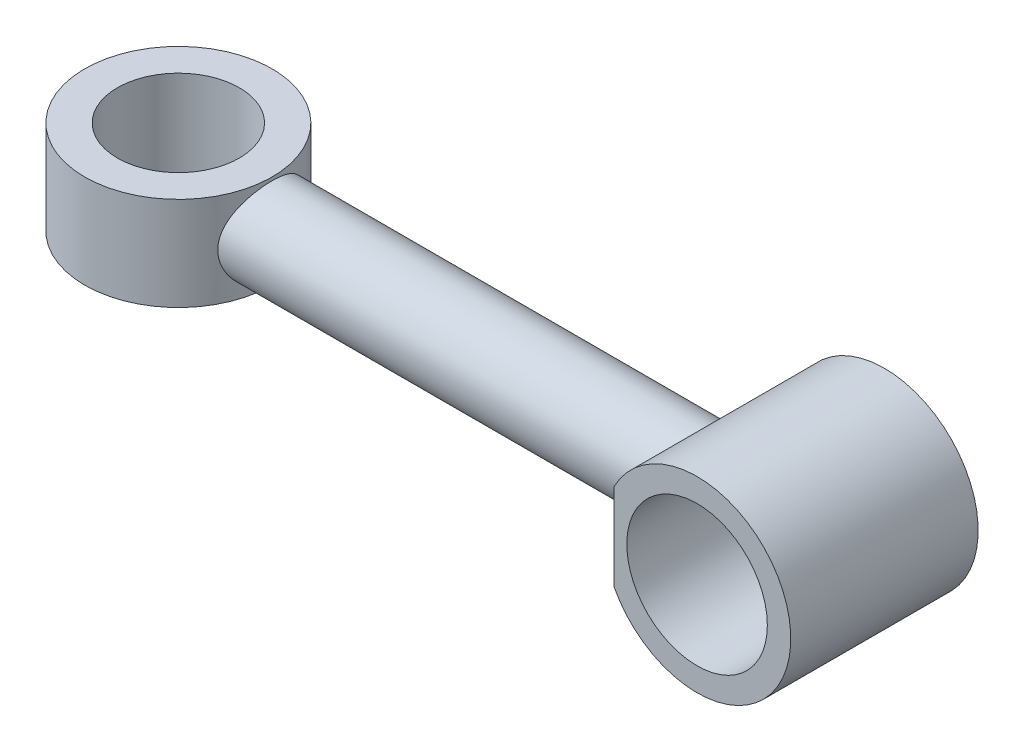
ISO-10303-21;
HEADER;
FILE_DESCRIPTION(('STEP AP214'),'2;1');
FILE_NAME('part.step','',(''),(''),'','','');
FILE_SCHEMA(('AUTOMOTIVE_DESIGN { 1 0 10303 214 1 1 1 1 }'));
ENDSEC;
DATA;
#1=APPLICATION_CONTEXT('core data for automotive mechanical design processes');
#2=APPLICATION_PROTOCOL_DEFINITION('international standard','automotive_design',2000,#1);
#3=PRODUCT_CONTEXT('',#1,'mechanical');
#4=PRODUCT('Part','Part','',(#3));
#5=PRODUCT_RELATED_PRODUCT_CATEGORY('part','',(#4));
#6=PRODUCT_DEFINITION_FORMATION('','',#4);
#7=PRODUCT_DEFINITION_CONTEXT('part definition',#1,'design');
#8=PRODUCT_DEFINITION('design','',#6,#7);
#9=PRODUCT_DEFINITION_SHAPE('','',#8);
#10=(LENGTH_UNIT() NAMED_UNIT(*) SI_UNIT(.MILLI.,.METRE.));
#11=(NAMED_UNIT(*) PLANE_ANGLE_UNIT() SI_UNIT($,.RADIAN.));
#12=(NAMED_UNIT(*) SI_UNIT($,.STERADIAN.) SOLID_ANGLE_UNIT());
#13=UNCERTAINTY_MEASURE_WITH_UNIT(LENGTH_MEASURE(1.E-05),#10,'distance_accuracy_value','');
#14=(GEOMETRIC_REPRESENTATION_CONTEXT(3) GLOBAL_UNCERTAINTY_ASSIGNED_CONTEXT((#13)) GLOBAL_UNIT_ASSIGNED_CONTEXT((#10,
#11,#12)) REPRESENTATION_CONTEXT('',''));
#15=CARTESIAN_POINT('',(0.,0.,0.));
#16=DIRECTION('',(0.,0.,1.));
#17=DIRECTION('',(1.,0.,0.));
#18=AXIS2_PLACEMENT_3D('',#15,#16,#17);
#19=CARTESIAN_POINT('',(-8.85201294053231,4.6520819963376,0.));
#20=DIRECTION('',(1.,0.,0.));
#21=DIRECTION('',(0.,0.,-1.));
#22=AXIS2_PLACEMENT_3D('',#19,#20,#21);
#23=PLANE('',#22);
#24=CARTESIAN_POINT('',(-8.85201294053231,0.,10.));
#25=DIRECTION('',(1.,0.,0.));
#26=DIRECTION('',(0.,0.,-1.));
#27=AXIS2_PLACEMENT_3D('',#24,#25,#26);
#28=CIRCLE('',#27,4.6520819963376);
#29=CARTESIAN_POINT('',(-8.85201294053231,-4.6520819963376,10.));
#30=VERTEX_POINT('',#29);
#31=CARTESIAN_POINT('',(-8.85201294053231,4.6520819963376,10.));
#32=VERTEX_POINT('',#31);
#33=EDGE_CURVE('E11',#30,#32,#28,.F.);
#34=ORIENTED_EDGE('',*,*,#33,.F.);
#35=DIRECTION('',(0.,0.,1.));
#36=VECTOR('',#35,1.);
#37=CARTESIAN_POINT('',(-8.85201294053231,-4.6520819963376,0.));
#38=LINE('',#37,#36);
#39=CARTESIAN_POINT('',(-8.85201294053231,-4.6520819963376,20.));
#40=VERTEX_POINT('',#39);
#41=EDGE_CURVE('E88',#30,#40,#38,.T.);
#42=ORIENTED_EDGE('',*,*,#41,.T.);
#43=DIRECTION('',(0.,1.,0.));
#44=VECTOR('',#43,1.);
#45=CARTESIAN_POINT('',(-8.85201294053231,4.6520819963376,20.));
#46=LINE('',#45,#44);
#47=CARTESIAN_POINT('',(-8.85201294053231,4.6520819963376,20.));
#48=VERTEX_POINT('',#47);
#49=EDGE_CURVE('E98',#40,#48,#46,.T.);
#50=ORIENTED_EDGE('',*,*,#49,.T.);
#51=DIRECTION('',(0.,0.,1.));
#52=VECTOR('',#51,1.);
#53=CARTESIAN_POINT('',(-8.85201294053231,4.6520819963376,0.));
#54=LINE('',#53,#52);
#55=EDGE_CURVE('E68',#32,#48,#54,.T.);
#56=ORIENTED_EDGE('',*,*,#55,.F.);
#57=EDGE_LOOP('',(#34,#42,#50,#56));
#58=FACE_BOUND('',#57,.T.);
#59=ADVANCED_FACE('F39',(#58),#23,.F.);
#60=CARTESIAN_POINT('',(0.,0.,20.));
#61=DIRECTION('',(0.,0.,1.));
#62=DIRECTION('',(1.,0.,0.));
#63=AXIS2_PLACEMENT_3D('',#60,#61,#62);
#64=PLANE('',#63);
#65=ORIENTED_EDGE('',*,*,#49,.F.);
#66=CARTESIAN_POINT('',(0.,0.,20.));
#67=DIRECTION('',(0.,0.,1.));
#68=DIRECTION('',(1.,0.,0.));
#69=AXIS2_PLACEMENT_3D('',#66,#67,#68);
#70=CIRCLE('',#69,10.);
#71=EDGE_CURVE('E54',#40,#48,#70,.T.);
#72=ORIENTED_EDGE('',*,*,#71,.T.);
#73=EDGE_LOOP('',(#65,#72));
#74=FACE_BOUND('',#73,.T.);
#75=CARTESIAN_POINT('',(0.,0.,20.));
#76=DIRECTION('',(0.,0.,1.));
#77=DIRECTION('',(1.,0.,0.));
#78=AXIS2_PLACEMENT_3D('',#75,#76,#77);
#79=CIRCLE('',#78,7.5);
#80=CARTESIAN_POINT('',(7.5,0.,20.));
#81=VERTEX_POINT('',#80);
#82=EDGE_CURVE('E114',#81,#81,#79,.T.);
#83=ORIENTED_EDGE('',*,*,#82,.F.);
#84=EDGE_LOOP('',(#83));
#85=FACE_BOUND('',#84,.T.);
#86=ADVANCED_FACE('F129',(#74,#85),#64,.T.);
#87=CARTESIAN_POINT('',(0.,0.,0.));
#88=DIRECTION('',(0.,0.,1.));
#89=DIRECTION('',(1.,0.,0.));
#90=AXIS2_PLACEMENT_3D('',#87,#88,#89);
#91=PLANE('',#90);
#92=CARTESIAN_POINT('',(0.,0.,0.));
#93=DIRECTION('',(0.,0.,1.));
#94=DIRECTION('',(1.,0.,0.));
#95=AXIS2_PLACEMENT_3D('',#92,#93,#94);
#96=CIRCLE('',#95,10.);
#97=CARTESIAN_POINT('',(-8.85201294053231,-4.6520819963376,0.));
#98=VERTEX_POINT('',#97);
#99=CARTESIAN_POINT('',(-8.85201294053231,4.6520819963376,0.));
#100=VERTEX_POINT('',#99);
#101=EDGE_CURVE('E118',#98,#100,#96,.T.);
#102=ORIENTED_EDGE('',*,*,#101,.F.);
#103=DIRECTION('',(0.,1.,0.));
#104=VECTOR('',#103,1.);
#105=CARTESIAN_POINT('',(-8.85201294053231,4.6520819963376,0.));
#106=LINE('',#105,#104);
#107=EDGE_CURVE('E84',#98,#100,#106,.T.);
#108=ORIENTED_EDGE('',*,*,#107,.T.);
#109=EDGE_LOOP('',(#102,#108));
#110=FACE_BOUND('',#109,.T.);
#111=CARTESIAN_POINT('',(0.,0.,0.));
#112=DIRECTION('',(0.,0.,1.));
#113=DIRECTION('',(1.,0.,0.));
#114=AXIS2_PLACEMENT_3D('',#111,#112,#113);
#115=CIRCLE('',#114,7.5);
#116=CARTESIAN_POINT('',(7.5,0.,0.));
#117=VERTEX_POINT('',#116);
#118=EDGE_CURVE('E112',#117,#117,#115,.T.);
#119=ORIENTED_EDGE('',*,*,#118,.T.);
#120=EDGE_LOOP('',(#119));
#121=FACE_BOUND('',#120,.T.);
#122=ADVANCED_FACE('F126',(#110,#121),#91,.F.);
#123=CARTESIAN_POINT('',(0.,0.,20.));
#124=DIRECTION('',(0.,0.,-1.));
#125=DIRECTION('',(-1.,0.,0.));
#126=AXIS2_PLACEMENT_3D('',#123,#124,#125);
#127=CYLINDRICAL_SURFACE('',#126,10.);
#128=ORIENTED_EDGE('',*,*,#71,.F.);
#129=ORIENTED_EDGE('',*,*,#41,.F.);
#130=EDGE_CURVE('E80',#98,#30,#38,.T.);
#131=ORIENTED_EDGE('',*,*,#130,.F.);
#132=ORIENTED_EDGE('',*,*,#101,.T.);
#133=EDGE_CURVE('E110',#100,#32,#54,.T.);
#134=ORIENTED_EDGE('',*,*,#133,.T.);
#135=ORIENTED_EDGE('',*,*,#55,.T.);
#136=EDGE_LOOP('',(#128,#129,#131,#132,#134,#135));
#137=FACE_BOUND('',#136,.T.);
#138=ADVANCED_FACE('F41',(#137),#127,.T.);
#139=CARTESIAN_POINT('',(0.,0.,20.));
#140=DIRECTION('',(0.,0.,-1.));
#141=DIRECTION('',(-1.,0.,0.));
#142=AXIS2_PLACEMENT_3D('',#139,#140,#141);
#143=CYLINDRICAL_SURFACE('',#142,7.5);
#144=ORIENTED_EDGE('',*,*,#82,.T.);
#145=EDGE_LOOP('',(#144));
#146=FACE_BOUND('',#145,.T.);
#147=ORIENTED_EDGE('',*,*,#118,.F.);
#148=EDGE_LOOP('',(#147));
#149=FACE_BOUND('',#148,.T.);
#150=ADVANCED_FACE('F132',(#146,#149),#143,.F.);
#151=CARTESIAN_POINT('',(-8.85201294053231,0.,10.));
#152=DIRECTION('',(-1.,0.,0.));
#153=DIRECTION('',(0.,0.,1.));
#154=AXIS2_PLACEMENT_3D('',#151,#152,#153);
#155=CIRCLE('',#154,4.6520819963376);
#156=EDGE_CURVE('E61',#32,#30,#155,.T.);
#157=ORIENTED_EDGE('',*,*,#156,.F.);
#158=ORIENTED_EDGE('',*,*,#133,.F.);
#159=ORIENTED_EDGE('',*,*,#107,.F.);
#160=ORIENTED_EDGE('',*,*,#130,.T.);
#161=EDGE_LOOP('',(#157,#158,#159,#160));
#162=FACE_BOUND('',#161,.T.);
#163=ADVANCED_FACE('F82',(#162),#23,.F.);
#164=CARTESIAN_POINT('',(-58.8520129405323,0.,10.));
#165=DIRECTION('',(1.,0.,0.));
#166=DIRECTION('',(0.,0.,-1.));
#167=AXIS2_PLACEMENT_3D('',#164,#165,#166);
#168=CYLINDRICAL_SURFACE('',#167,4.6520819963376);
#169=CARTESIAN_POINT('',(-56.506978502493,0.,5.3479180036624));
#170=CARTESIAN_POINT('',(-56.5069773564305,0.122525390572424,5.34791899214925));
#171=CARTESIAN_POINT('',(-56.5044256198077,0.245076522623798,5.35276560064441));
#172=CARTESIAN_POINT('',(-56.4943084601485,0.489257097043699,5.37209441383605));
#173=CARTESIAN_POINT('',(-56.4867402841764,0.610885996216516,5.38658190930285));
#174=CARTESIAN_POINT('',(-56.4668414081276,0.852472261932097,5.4250531527452));
#175=CARTESIAN_POINT('',(-56.4545020173625,0.972426161972424,5.44905423157119));
#176=CARTESIAN_POINT('',(-56.4254941904535,1.20959958503441,5.50626604699684));
#177=CARTESIAN_POINT('',(-56.4088239022721,1.32681791480549,5.53948072405437));
#178=CARTESIAN_POINT('',(-56.3533003922723,1.67199118023928,5.65206131771073));
#179=CARTESIAN_POINT('',(-56.3088061697581,1.89489667928971,5.74459667207427));
#180=CARTESIAN_POINT('',(-56.2099049345903,2.32185099604744,5.96164021171857));
#181=CARTESIAN_POINT('',(-56.1554985979806,2.52590109833467,6.08614621671664));
#182=CARTESIAN_POINT('',(-56.0381691515242,2.92551059025472,6.3739690894666));
#183=CARTESIAN_POINT('',(-55.9749156953672,3.11944238835001,6.53941171090672));
#184=CARTESIAN_POINT('',(-55.8496767553235,3.47810789877057,6.90011591547991));
#185=CARTESIAN_POINT('',(-55.7876918467046,3.64282861293846,7.09539070155226));
#186=CARTESIAN_POINT('',(-55.698636193837,3.86904044284971,7.41337134785351));
#187=CARTESIAN_POINT('',(-55.6688752881573,3.94260289110731,7.52692006518738));
#188=CARTESIAN_POINT('',(-55.6122414968064,4.07981765560648,7.76051840281186));
#189=CARTESIAN_POINT('',(-55.5853674056241,4.14347411353349,7.88056527777922));
#190=CARTESIAN_POINT('',(-55.5352768655653,4.26028387800606,8.12640088465893));
#191=CARTESIAN_POINT('',(-55.51206053341,4.31343684939278,8.25218979963812));
#192=CARTESIAN_POINT('',(-55.4699868847591,4.40863953142218,8.50854311943574));
#193=CARTESIAN_POINT('',(-55.4511272408858,4.45069517206414,8.63910493115465));
#194=CARTESIAN_POINT('',(-55.4193627362714,4.52095164666888,8.89571870114097));
#195=CARTESIAN_POINT('',(-55.406159092071,4.5498547954339,9.02154159774605));
#196=CARTESIAN_POINT('',(-55.384457736606,4.59713299213321,9.27549568304447));
#197=CARTESIAN_POINT('',(-55.3759578152258,4.61551298467318,9.40362575840313));
#198=CARTESIAN_POINT('',(-55.3639019460221,4.64153142410757,9.6611756432376));
#199=CARTESIAN_POINT('',(-55.3603449140917,4.64917222639577,9.79059516363026));
#200=CARTESIAN_POINT('',(-55.3582759612749,4.65362028106697,10.0496576426266));
#201=CARTESIAN_POINT('',(-55.3597637840483,4.65042808389864,10.179300589543));
#202=CARTESIAN_POINT('',(-55.3674363502393,4.63390621624393,10.4279061909035));
#203=CARTESIAN_POINT('',(-55.3732564382472,4.62136348078345,10.5469333833404));
#204=CARTESIAN_POINT('',(-55.3890227022541,4.58719664458382,10.7834380017869));
#205=CARTESIAN_POINT('',(-55.3989702228692,4.56556958436607,10.9009149098716));
#206=CARTESIAN_POINT('',(-55.4227475397574,4.51346304358937,11.1334484178614));
#207=CARTESIAN_POINT('',(-55.4365760322667,4.48298653577212,11.2485058166412));
#208=CARTESIAN_POINT('',(-55.4677842982898,4.41347941238058,11.4755281869384));
#209=CARTESIAN_POINT('',(-55.4851654322525,4.3744455194238,11.5874919550794));
#210=CARTESIAN_POINT('',(-55.5426151447299,4.2437444456033,11.9209195575345));
#211=CARTESIAN_POINT('',(-55.5876407322957,4.13921551503283,12.1366503311589));
#212=CARTESIAN_POINT('',(-55.6867186419094,3.89956317580102,12.547952624986));
#213=CARTESIAN_POINT('',(-55.7407742724146,3.76442854724246,12.7435167138229));
#214=CARTESIAN_POINT('',(-55.8580863736177,3.45418928509174,13.1266982830168));
#215=CARTESIAN_POINT('',(-55.9217343519972,3.27666991997803,13.3122427186874));
#216=CARTESIAN_POINT('',(-56.0479384119789,2.89314368077919,13.6520137164851));
#217=CARTESIAN_POINT('',(-56.1104938265993,2.6871200461578,13.8062217200841));
#218=CARTESIAN_POINT('',(-56.1998084471765,2.35471281488794,14.0144074373657));
#219=CARTESIAN_POINT('',(-56.22946184461,2.23695943325057,14.0812112589849));
#220=CARTESIAN_POINT('',(-56.2856042286382,1.99549235149056,14.2045487853519));
#221=CARTESIAN_POINT('',(-56.312094623187,1.8717813379742,14.2610870655005));
#222=CARTESIAN_POINT('',(-56.3609565537676,1.61921106967964,14.3633224569669));
#223=CARTESIAN_POINT('',(-56.3833291948976,1.49035320751314,14.4090224779449));
#224=CARTESIAN_POINT('',(-56.4230790745766,1.22846507573034,14.4890388142674));
#225=CARTESIAN_POINT('',(-56.4404591953404,1.09543726285527,14.523361699476));
#226=CARTESIAN_POINT('',(-56.4684301487041,0.83624028235974,14.5780773551975));
#227=CARTESIAN_POINT('',(-56.479428492731,0.710292880776842,14.5993135847827));
#228=CARTESIAN_POINT('',(-56.4961024370839,0.456784246957418,14.631363453629));
#229=CARTESIAN_POINT('',(-56.5017806342558,0.329223832906751,14.6421821779071));
#230=CARTESIAN_POINT('',(-56.5075953859004,0.0735474847850992,14.6532598701612));
#231=CARTESIAN_POINT('',(-56.5077331933858,-0.0545683171243881,14.6535212257883));
#232=CARTESIAN_POINT('',(-56.502465081671,-0.310265104138449,14.6434871197661));
#233=CARTESIAN_POINT('',(-56.4970594301565,-0.437846114768636,14.6331921678657));
#234=CARTESIAN_POINT('',(-56.4816361724963,-0.680145997855056,14.6035653616898));
#235=CARTESIAN_POINT('',(-56.4720698922921,-0.795002472665295,14.5851155235195));
#236=CARTESIAN_POINT('',(-56.4488259774413,-1.02262617027408,14.5397786528975));
#237=CARTESIAN_POINT('',(-56.4351470257682,-1.13539271150062,14.5128889175632));
#238=CARTESIAN_POINT('',(-56.3885411957814,-1.46945336353401,14.419943274112));
#239=CARTESIAN_POINT('',(-56.3500334982933,-1.68667956457947,14.3415895913761));
#240=CARTESIAN_POINT('',(-56.2603729579536,-2.11488554298696,14.1505062012594));
#241=CARTESIAN_POINT('',(-56.2087206573115,-2.32512045481469,14.0363631914079));
#242=CARTESIAN_POINT('',(-56.0991413473549,-2.72463384572908,13.778203278404));
#243=CARTESIAN_POINT('',(-56.0412112537724,-2.91390193066711,13.6341716589507));
#244=CARTESIAN_POINT('',(-55.9182176974141,-3.28699615132806,13.3024679147665));
#245=CARTESIAN_POINT('',(-55.8530489940692,-3.46811887704402,13.1117882509423));
#246=CARTESIAN_POINT('',(-55.7283731855698,-3.79655064567321,12.7013042374079));
#247=CARTESIAN_POINT('',(-55.6688672422931,-3.94385275803721,12.481493932751));
#248=CARTESIAN_POINT('',(-55.5882206796157,-4.13681904768243,12.132298421441));
#249=CARTESIAN_POINT('',(-55.5626137927666,-4.19682134026574,12.0116647955825));
#250=CARTESIAN_POINT('',(-55.515192503254,-4.30635477696942,11.7650352912999));
#251=CARTESIAN_POINT('',(-55.4933764470812,-4.35589048851825,11.6390417807893));
#252=CARTESIAN_POINT('',(-55.4541890059746,-4.44393184181888,11.3826455892799));
#253=CARTESIAN_POINT('',(-55.4368158875326,-4.48244178621507,11.2522446504872));
#254=CARTESIAN_POINT('',(-55.4070343833175,-4.5479853802347,10.9880349739255));
#255=CARTESIAN_POINT('',(-55.3946255057375,-4.57502016671722,10.8542265751311));
#256=CARTESIAN_POINT('',(-55.3759733808203,-4.61549662691799,10.5955999271912));
#257=CARTESIAN_POINT('',(-55.3693032603716,-4.62988164039909,10.4709592717544));
#258=CARTESIAN_POINT('',(-55.3606452231498,-4.64853346559387,10.2207637391577));
#259=CARTESIAN_POINT('',(-55.3586570222836,-4.65280089123027,10.0952089179321));
#260=CARTESIAN_POINT('',(-55.3594176172092,-4.65116586888817,9.84420948572512));
#261=CARTESIAN_POINT('',(-55.3621653379049,-4.64526572903682,9.71876485619692));
#262=CARTESIAN_POINT('',(-55.3723193823165,-4.62337314332747,9.46895375398239));
#263=CARTESIAN_POINT('',(-55.3797256284875,-4.60738086546082,9.34458726338455));
#264=CARTESIAN_POINT('',(-55.3984943280259,-4.56658306385098,9.10431753317648));
#265=CARTESIAN_POINT('',(-55.4096304766998,-4.54228030314614,8.98831101851924));
#266=CARTESIAN_POINT('',(-55.435637411112,-4.48502654871144,8.75886883375274));
#267=CARTESIAN_POINT('',(-55.4505094015259,-4.45207276518074,8.64543400580946));
#268=CARTESIAN_POINT('',(-55.500230411483,-4.34068225238299,8.31011625880283));
#269=CARTESIAN_POINT('',(-55.5402008359469,-4.24968214117974,8.09302145212114));
#270=CARTESIAN_POINT('',(-55.6323137079272,-4.03239592519278,7.66731198481283));
#271=CARTESIAN_POINT('',(-55.6849265097218,-3.90469499125793,7.45953021862761));
#272=CARTESIAN_POINT('',(-55.7964898360586,-3.61946342246153,7.06739863506682));
#273=CARTESIAN_POINT('',(-55.8554431974427,-3.46191941125351,6.88305938732541));
#274=CARTESIAN_POINT('',(-55.979632032514,-3.10556620059839,6.52633761632132));
#275=CARTESIAN_POINT('',(-56.044968786238,-2.90436272631701,6.35637999623524));
#276=CARTESIAN_POINT('',(-56.1698764028931,-2.47463085741082,6.05192088690858));
#277=CARTESIAN_POINT('',(-56.2294431997053,-2.2460834432561,5.91744428793141));
#278=CARTESIAN_POINT('',(-56.3091958372094,-1.88539860865043,5.74497006680388));
#279=CARTESIAN_POINT('',(-56.3343195135504,-1.76127478630639,5.692091452908));
#280=CARTESIAN_POINT('',(-56.3802708083898,-1.50822233833937,5.59711890523367));
#281=CARTESIAN_POINT('',(-56.4011006075465,-1.37929619106678,5.5550194945617));
#282=CARTESIAN_POINT('',(-56.4376014054891,-1.11793271789195,5.48220663460323));
#283=CARTESIAN_POINT('',(-56.4532858649363,-0.985505548943405,5.45146344941585));
#284=CARTESIAN_POINT('',(-56.4789037719428,-0.717993535932772,5.40164863711266));
#285=CARTESIAN_POINT('',(-56.4888414299512,-0.582910712783243,5.38256846439327));
#286=CARTESIAN_POINT('',(-56.4994387879155,-0.372899650924466,5.36228685296992));
#287=CARTESIAN_POINT('',(-56.5022621719897,-0.298456698924561,5.35690162842546));
#288=CARTESIAN_POINT('',(-56.5060324205486,-0.14934569200289,5.34971682225462));
#289=CARTESIAN_POINT('',(-56.5069792010031,-0.074677627150996,5.34791740119255));
#290=CARTESIAN_POINT('',(-56.506978502493,0.,5.3479180036624));
#291=B_SPLINE_CURVE_WITH_KNOTS('',3,(#169,#170,#171,#172,#173,#174,#175,#176,#177,#178,#179,
#180,#181,#182,#183,#184,#185,#186,#187,#188,#189,#190,#191,#192,#193,#194,#195,#196,#197,#198,
#199,#200,#201,#202,#203,#204,#205,#206,#207,#208,#209,#210,#211,#212,#213,#214,#215,#216,#217,
#218,#219,#220,#221,#222,#223,#224,#225,#226,#227,#228,#229,#230,#231,#232,#233,#234,#235,#236,
#237,#238,#239,#240,#241,#242,#243,#244,#245,#246,#247,#248,#249,#250,#251,#252,#253,#254,#255,
#256,#257,#258,#259,#260,#261,#262,#263,#264,#265,#266,#267,#268,#269,#270,#271,#272,#273,#274,
#275,#276,#277,#278,#279,#280,#281,#282,#283,#284,#285,#286,#287,#288,#289,#290),.UNSPECIFIED.,
.T.,.F.,(4,2,2,2,2,2,2,2,2,2,2,2,2,2,2,2,2,2,2,2,2,2,2,2,2,2,2,2,2,2,2,2,2,2,2,2,2,2,2,2,2,2,2,
2,2,2,2,2,2,2,2,2,2,2,2,2,2,2,2,2,4),(0.,0.367498690666921,0.735199225456315,1.10357269994376,
1.47210396339162,2.20485149772054,2.93754907458408,3.72219253904647,4.50718427771305,
4.9223240468388,5.33728977735494,5.75226874699716,6.167025516239,6.55582769167615,
6.94444702704891,7.33298111442288,7.72149545981588,8.08055407762554,8.43972975988274,
8.79878492572325,9.15797784664809,9.8863544465616,10.6149984991814,11.4053049798261,
12.19607815214,12.611403411082,13.0265431007225,13.4415712146743,13.8563592464188,
14.2404256472589,14.6243044815317,15.0080964974001,15.3918699813731,15.7416223519457,
16.0914868454264,16.7907036082616,17.5220277779161,18.2537128888067,19.06295577342,
19.8723643410702,20.2833345598273,20.6941250664536,21.104755048916,21.5153443402224,
21.8917936349647,22.2682200866447,22.6445610974527,23.0208958439428,23.3776169667748,
23.7344532674327,24.4475263947331,25.1929838833745,25.9387762970564,26.7492730051628,
27.5603367815033,27.9715743958783,28.3826026446573,28.79254686945,29.2021903629111,
29.4261659917692,29.6501516495328),.UNSPECIFIED.);
#292=CARTESIAN_POINT('',(-56.506978502493,0.,5.3479180036624));
#293=VERTEX_POINT('',#292);
#294=EDGE_CURVE('E43',#293,#293,#291,.T.);
#295=ORIENTED_EDGE('',*,*,#294,.T.);
#296=EDGE_LOOP('',(#295));
#297=FACE_BOUND('',#296,.T.);
#298=ORIENTED_EDGE('',*,*,#156,.T.);
#299=ORIENTED_EDGE('',*,*,#33,.T.);
#300=EDGE_LOOP('',(#298,#299));
#301=FACE_BOUND('',#300,.T.);
#302=ADVANCED_FACE('F96',(#297,#301),#168,.T.);
#303=CARTESIAN_POINT('',(-65.3589914430253,-5.,10.));
#304=DIRECTION('',(0.,1.,0.));
#305=DIRECTION('',(0.,0.,1.));
#306=AXIS2_PLACEMENT_3D('',#303,#304,#305);
#307=CYLINDRICAL_SURFACE('',#306,10.);
#308=CARTESIAN_POINT('',(-65.3589914430253,-5.,10.));
#309=DIRECTION('',(0.,1.,0.));
#310=DIRECTION('',(0.,0.,1.));
#311=AXIS2_PLACEMENT_3D('',#308,#309,#310);
#312=CIRCLE('',#311,10.);
#313=CARTESIAN_POINT('',(-65.3589914430253,-5.,20.));
#314=VERTEX_POINT('',#313);
#315=EDGE_CURVE('E104',#314,#314,#312,.T.);
#316=ORIENTED_EDGE('',*,*,#315,.T.);
#317=EDGE_LOOP('',(#316));
#318=FACE_BOUND('',#317,.T.);
#319=CARTESIAN_POINT('',(-65.3589914430253,5.,10.));
#320=DIRECTION('',(0.,1.,0.));
#321=DIRECTION('',(0.,0.,1.));
#322=AXIS2_PLACEMENT_3D('',#319,#320,#321);
#323=CIRCLE('',#322,10.);
#324=CARTESIAN_POINT('',(-65.3589914430253,5.,20.));
#325=VERTEX_POINT('',#324);
#326=EDGE_CURVE('E171',#325,#325,#323,.T.);
#327=ORIENTED_EDGE('',*,*,#326,.F.);
#328=EDGE_LOOP('',(#327));
#329=FACE_BOUND('',#328,.T.);
#330=ORIENTED_EDGE('',*,*,#294,.F.);
#331=EDGE_LOOP('',(#330));
#332=FACE_BOUND('',#331,.T.);
#333=ADVANCED_FACE('F149',(#318,#329,#332),#307,.T.);
#334=CARTESIAN_POINT('',(-65.3589914430253,-5.,10.));
#335=DIRECTION('',(0.,1.,0.));
#336=DIRECTION('',(0.,0.,1.));
#337=AXIS2_PLACEMENT_3D('',#334,#335,#336);
#338=PLANE('',#337);
#339=CARTESIAN_POINT('',(-65.3589914430253,-5.,10.));
#340=DIRECTION('',(0.,1.,0.));
#341=DIRECTION('',(0.,0.,1.));
#342=AXIS2_PLACEMENT_3D('',#339,#340,#341);
#343=CIRCLE('',#342,6.50697850249298);
#344=CARTESIAN_POINT('',(-65.3589914430253,-5.,16.506978502493));
#345=VERTEX_POINT('',#344);
#346=EDGE_CURVE('E179',#345,#345,#343,.T.);
#347=ORIENTED_EDGE('',*,*,#346,.T.);
#348=EDGE_LOOP('',(#347));
#349=FACE_BOUND('',#348,.T.);
#350=ORIENTED_EDGE('',*,*,#315,.F.);
#351=EDGE_LOOP('',(#350));
#352=FACE_BOUND('',#351,.T.);
#353=ADVANCED_FACE('F154',(#349,#352),#338,.F.);
#354=CARTESIAN_POINT('',(-65.3589914430253,-5.,10.));
#355=DIRECTION('',(0.,1.,0.));
#356=DIRECTION('',(0.,0.,1.));
#357=AXIS2_PLACEMENT_3D('',#354,#355,#356);
#358=CYLINDRICAL_SURFACE('',#357,6.50697850249298);
#359=ORIENTED_EDGE('',*,*,#346,.F.);
#360=EDGE_LOOP('',(#359));
#361=FACE_BOUND('',#360,.T.);
#362=CARTESIAN_POINT('',(-65.3589914430253,5.,10.));
#363=DIRECTION('',(0.,1.,0.));
#364=DIRECTION('',(0.,0.,1.));
#365=AXIS2_PLACEMENT_3D('',#362,#363,#364);
#366=CIRCLE('',#365,6.50697850249298);
#367=CARTESIAN_POINT('',(-65.3589914430253,5.,16.506978502493));
#368=VERTEX_POINT('',#367);
#369=EDGE_CURVE('E174',#368,#368,#366,.T.);
#370=ORIENTED_EDGE('',*,*,#369,.T.);
#371=EDGE_LOOP('',(#370));
#372=FACE_BOUND('',#371,.T.);
#373=ADVANCED_FACE('F158',(#361,#372),#358,.F.);
#374=CARTESIAN_POINT('',(-65.3589914430253,5.,10.));
#375=DIRECTION('',(0.,1.,0.));
#376=DIRECTION('',(0.,0.,1.));
#377=AXIS2_PLACEMENT_3D('',#374,#375,#376);
#378=PLANE('',#377);
#379=ORIENTED_EDGE('',*,*,#326,.T.);
#380=EDGE_LOOP('',(#379));
#381=FACE_BOUND('',#380,.T.);
#382=ORIENTED_EDGE('',*,*,#369,.F.);
#383=EDGE_LOOP('',(#382));
#384=FACE_BOUND('',#383,.T.);
#385=ADVANCED_FACE('F162',(#381,#384),#378,.T.);
#386=CLOSED_SHELL('',(#59,#86,#122,#138,#150,#163,#302,#333,#353,#373,#385));
#387=MANIFOLD_SOLID_BREP('B2',#386);
#388=ADVANCED_BREP_SHAPE_REPRESENTATION('',(#18,#387),#14);
#389=SHAPE_DEFINITION_REPRESENTATION(#9,#388);
ENDSEC;
END-ISO-10303-21;
